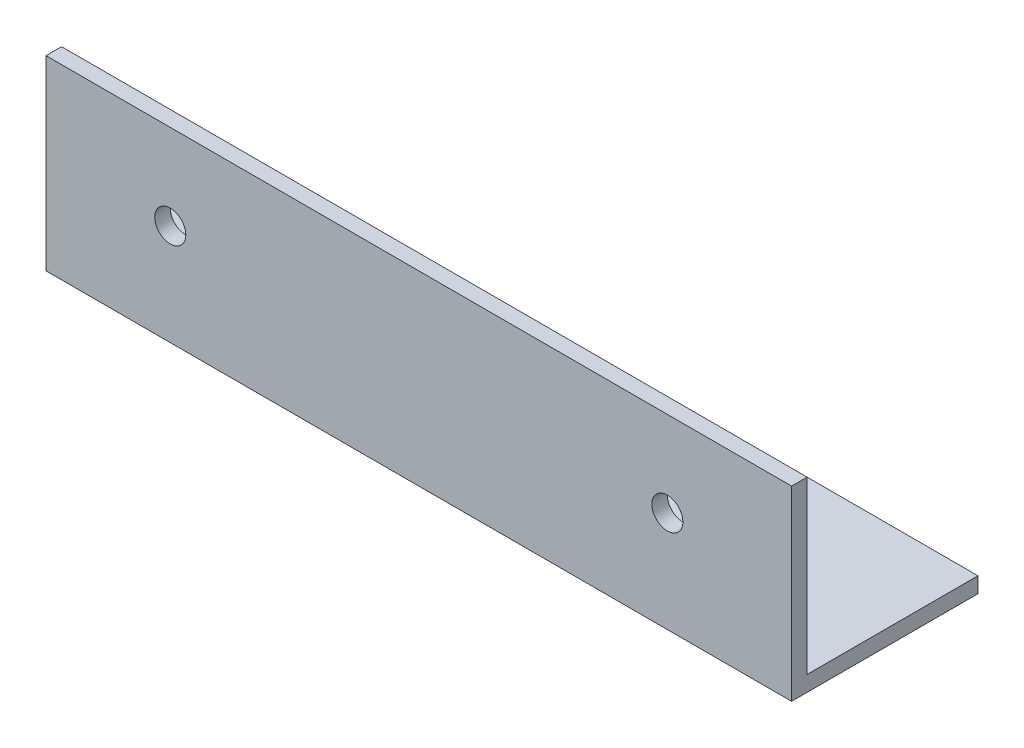
ISO-10303-21;
HEADER;
FILE_DESCRIPTION(('STEP AP214'),'2;1');
FILE_NAME('part.step','',(''),(''),'','','');
FILE_SCHEMA(('AUTOMOTIVE_DESIGN { 1 0 10303 214 1 1 1 1 }'));
ENDSEC;
DATA;
#1=APPLICATION_CONTEXT('core data for automotive mechanical design processes');
#2=APPLICATION_PROTOCOL_DEFINITION('international standard','automotive_design',2000,#1);
#3=PRODUCT_CONTEXT('',#1,'mechanical');
#4=PRODUCT('Part','Part','',(#3));
#5=PRODUCT_RELATED_PRODUCT_CATEGORY('part','',(#4));
#6=PRODUCT_DEFINITION_FORMATION('','',#4);
#7=PRODUCT_DEFINITION_CONTEXT('part definition',#1,'design');
#8=PRODUCT_DEFINITION('design','',#6,#7);
#9=PRODUCT_DEFINITION_SHAPE('','',#8);
#10=(LENGTH_UNIT() NAMED_UNIT(*) SI_UNIT(.MILLI.,.METRE.));
#11=(NAMED_UNIT(*) PLANE_ANGLE_UNIT() SI_UNIT($,.RADIAN.));
#12=(NAMED_UNIT(*) SI_UNIT($,.STERADIAN.) SOLID_ANGLE_UNIT());
#13=UNCERTAINTY_MEASURE_WITH_UNIT(LENGTH_MEASURE(1.E-05),#10,'distance_accuracy_value','');
#14=(GEOMETRIC_REPRESENTATION_CONTEXT(3) GLOBAL_UNCERTAINTY_ASSIGNED_CONTEXT((#13)) GLOBAL_UNIT_ASSIGNED_CONTEXT((#10,
#11,#12)) REPRESENTATION_CONTEXT('',''));
#15=CARTESIAN_POINT('',(0.,0.,0.));
#16=DIRECTION('',(0.,0.,1.));
#17=DIRECTION('',(1.,0.,0.));
#18=AXIS2_PLACEMENT_3D('',#15,#16,#17);
#19=CARTESIAN_POINT('',(152.4,0.,-38.1));
#20=DIRECTION('',(0.,1.,0.));
#21=DIRECTION('',(0.,0.,1.));
#22=AXIS2_PLACEMENT_3D('',#19,#20,#21);
#23=PLANE('',#22);
#24=CARTESIAN_POINT('',(127.,0.,-20.6375));
#25=DIRECTION('',(0.,1.,0.));
#26=DIRECTION('',(0.,0.,-1.));
#27=AXIS2_PLACEMENT_3D('',#24,#25,#26);
#28=CIRCLE('',#27,3.175);
#29=CARTESIAN_POINT('',(127.,0.,-23.8125));
#30=VERTEX_POINT('',#29);
#31=EDGE_CURVE('E163',#30,#30,#28,.T.);
#32=ORIENTED_EDGE('',*,*,#31,.T.);
#33=EDGE_LOOP('',(#32));
#34=FACE_BOUND('',#33,.T.);
#35=CARTESIAN_POINT('',(25.4,0.,-20.6375));
#36=DIRECTION('',(0.,1.,0.));
#37=DIRECTION('',(0.,0.,1.));
#38=AXIS2_PLACEMENT_3D('',#35,#36,#37);
#39=CIRCLE('',#38,3.175);
#40=CARTESIAN_POINT('',(25.4,0.,-17.4625));
#41=VERTEX_POINT('',#40);
#42=EDGE_CURVE('E166',#41,#41,#39,.T.);
#43=ORIENTED_EDGE('',*,*,#42,.T.);
#44=EDGE_LOOP('',(#43));
#45=FACE_BOUND('',#44,.T.);
#46=DIRECTION('',(0.,0.,-1.));
#47=VECTOR('',#46,1.);
#48=CARTESIAN_POINT('',(0.,0.,-38.1));
#49=LINE('',#48,#47);
#50=CARTESIAN_POINT('',(0.,0.,0.));
#51=VERTEX_POINT('',#50);
#52=CARTESIAN_POINT('',(0.,0.,-38.1));
#53=VERTEX_POINT('',#52);
#54=EDGE_CURVE('E117',#51,#53,#49,.T.);
#55=ORIENTED_EDGE('',*,*,#54,.T.);
#56=DIRECTION('',(-1.,0.,0.));
#57=VECTOR('',#56,1.);
#58=CARTESIAN_POINT('',(152.4,0.,-38.1));
#59=LINE('',#58,#57);
#60=CARTESIAN_POINT('',(152.4,0.,-38.1));
#61=VERTEX_POINT('',#60);
#62=EDGE_CURVE('E11',#61,#53,#59,.T.);
#63=ORIENTED_EDGE('',*,*,#62,.F.);
#64=DIRECTION('',(0.,0.,-1.));
#65=VECTOR('',#64,1.);
#66=CARTESIAN_POINT('',(152.4,0.,-38.1));
#67=LINE('',#66,#65);
#68=CARTESIAN_POINT('',(152.4,0.,0.));
#69=VERTEX_POINT('',#68);
#70=EDGE_CURVE('E128',#69,#61,#67,.T.);
#71=ORIENTED_EDGE('',*,*,#70,.F.);
#72=DIRECTION('',(-1.,0.,0.));
#73=VECTOR('',#72,1.);
#74=CARTESIAN_POINT('',(152.4,0.,0.));
#75=LINE('',#74,#73);
#76=EDGE_CURVE('E113',#69,#51,#75,.T.);
#77=ORIENTED_EDGE('',*,*,#76,.T.);
#78=EDGE_LOOP('',(#55,#63,#71,#77));
#79=FACE_BOUND('',#78,.T.);
#80=ADVANCED_FACE('F33',(#34,#45,#79),#23,.F.);
#81=CARTESIAN_POINT('',(152.4,3.175,-38.1));
#82=DIRECTION('',(0.,0.,1.));
#83=DIRECTION('',(1.,0.,0.));
#84=AXIS2_PLACEMENT_3D('',#81,#82,#83);
#85=PLANE('',#84);
#86=DIRECTION('',(0.,1.,0.));
#87=VECTOR('',#86,1.);
#88=CARTESIAN_POINT('',(0.,3.175,-38.1));
#89=LINE('',#88,#87);
#90=CARTESIAN_POINT('',(0.,3.175,-38.1));
#91=VERTEX_POINT('',#90);
#92=EDGE_CURVE('E120',#53,#91,#89,.T.);
#93=ORIENTED_EDGE('',*,*,#92,.T.);
#94=DIRECTION('',(-1.,0.,0.));
#95=VECTOR('',#94,1.);
#96=CARTESIAN_POINT('',(152.4,3.175,-38.1));
#97=LINE('',#96,#95);
#98=CARTESIAN_POINT('',(152.4,3.175,-38.1));
#99=VERTEX_POINT('',#98);
#100=EDGE_CURVE('E41',#99,#91,#97,.T.);
#101=ORIENTED_EDGE('',*,*,#100,.F.);
#102=DIRECTION('',(0.,1.,0.));
#103=VECTOR('',#102,1.);
#104=CARTESIAN_POINT('',(152.4,3.175,-38.1));
#105=LINE('',#104,#103);
#106=EDGE_CURVE('E86',#61,#99,#105,.T.);
#107=ORIENTED_EDGE('',*,*,#106,.F.);
#108=ORIENTED_EDGE('',*,*,#62,.T.);
#109=EDGE_LOOP('',(#93,#101,#107,#108));
#110=FACE_BOUND('',#109,.T.);
#111=ADVANCED_FACE('F155',(#110),#85,.F.);
#112=CARTESIAN_POINT('',(152.4,3.175,-3.175));
#113=DIRECTION('',(0.,-1.,0.));
#114=DIRECTION('',(0.,0.,-1.));
#115=AXIS2_PLACEMENT_3D('',#112,#113,#114);
#116=PLANE('',#115);
#117=CARTESIAN_POINT('',(127.,3.175,-20.6375));
#118=DIRECTION('',(0.,1.,0.));
#119=DIRECTION('',(0.,0.,-1.));
#120=AXIS2_PLACEMENT_3D('',#117,#118,#119);
#121=CIRCLE('',#120,3.175);
#122=CARTESIAN_POINT('',(127.,3.175,-23.8125));
#123=VERTEX_POINT('',#122);
#124=EDGE_CURVE('E177',#123,#123,#121,.T.);
#125=ORIENTED_EDGE('',*,*,#124,.F.);
#126=EDGE_LOOP('',(#125));
#127=FACE_BOUND('',#126,.T.);
#128=CARTESIAN_POINT('',(25.4,3.175,-20.6375));
#129=DIRECTION('',(0.,1.,0.));
#130=DIRECTION('',(0.,0.,1.));
#131=AXIS2_PLACEMENT_3D('',#128,#129,#130);
#132=CIRCLE('',#131,3.175);
#133=CARTESIAN_POINT('',(25.4,3.175,-17.4625));
#134=VERTEX_POINT('',#133);
#135=EDGE_CURVE('E169',#134,#134,#132,.T.);
#136=ORIENTED_EDGE('',*,*,#135,.F.);
#137=EDGE_LOOP('',(#136));
#138=FACE_BOUND('',#137,.T.);
#139=DIRECTION('',(0.,0.,1.));
#140=VECTOR('',#139,1.);
#141=CARTESIAN_POINT('',(0.,3.175,-3.175));
#142=LINE('',#141,#140);
#143=CARTESIAN_POINT('',(0.,3.175,-3.175));
#144=VERTEX_POINT('',#143);
#145=EDGE_CURVE('E123',#91,#144,#142,.T.);
#146=ORIENTED_EDGE('',*,*,#145,.T.);
#147=DIRECTION('',(-1.,0.,0.));
#148=VECTOR('',#147,1.);
#149=CARTESIAN_POINT('',(152.4,3.175,-3.175));
#150=LINE('',#149,#148);
#151=CARTESIAN_POINT('',(152.4,3.175,-3.175));
#152=VERTEX_POINT('',#151);
#153=EDGE_CURVE('E108',#152,#144,#150,.T.);
#154=ORIENTED_EDGE('',*,*,#153,.F.);
#155=DIRECTION('',(0.,0.,1.));
#156=VECTOR('',#155,1.);
#157=CARTESIAN_POINT('',(152.4,3.175,-3.175));
#158=LINE('',#157,#156);
#159=EDGE_CURVE('E99',#99,#152,#158,.T.);
#160=ORIENTED_EDGE('',*,*,#159,.F.);
#161=ORIENTED_EDGE('',*,*,#100,.T.);
#162=EDGE_LOOP('',(#146,#154,#160,#161));
#163=FACE_BOUND('',#162,.T.);
#164=ADVANCED_FACE('F134',(#127,#138,#163),#116,.F.);
#165=CARTESIAN_POINT('',(152.4,38.1,-3.175));
#166=DIRECTION('',(0.,0.,1.));
#167=DIRECTION('',(0.,-1.,0.));
#168=AXIS2_PLACEMENT_3D('',#165,#166,#167);
#169=PLANE('',#168);
#170=CARTESIAN_POINT('',(25.4,20.6375,-3.175));
#171=DIRECTION('',(0.,0.,-1.));
#172=DIRECTION('',(0.,-1.,0.));
#173=AXIS2_PLACEMENT_3D('',#170,#171,#172);
#174=CIRCLE('',#173,3.175);
#175=CARTESIAN_POINT('',(25.4,17.4625,-3.175));
#176=VERTEX_POINT('',#175);
#177=EDGE_CURVE('E168',#176,#176,#174,.T.);
#178=ORIENTED_EDGE('',*,*,#177,.F.);
#179=EDGE_LOOP('',(#178));
#180=FACE_BOUND('',#179,.T.);
#181=CARTESIAN_POINT('',(127.,20.6375,-3.175));
#182=DIRECTION('',(0.,0.,-1.));
#183=DIRECTION('',(0.,1.,0.));
#184=AXIS2_PLACEMENT_3D('',#181,#182,#183);
#185=CIRCLE('',#184,3.175);
#186=CARTESIAN_POINT('',(127.,23.8125,-3.175));
#187=VERTEX_POINT('',#186);
#188=EDGE_CURVE('E180',#187,#187,#185,.T.);
#189=ORIENTED_EDGE('',*,*,#188,.F.);
#190=EDGE_LOOP('',(#189));
#191=FACE_BOUND('',#190,.T.);
#192=DIRECTION('',(0.,1.,0.));
#193=VECTOR('',#192,1.);
#194=CARTESIAN_POINT('',(0.,38.1,-3.175));
#195=LINE('',#194,#193);
#196=CARTESIAN_POINT('',(0.,38.1,-3.175));
#197=VERTEX_POINT('',#196);
#198=EDGE_CURVE('E107',#144,#197,#195,.T.);
#199=ORIENTED_EDGE('',*,*,#198,.T.);
#200=DIRECTION('',(-1.,0.,0.));
#201=VECTOR('',#200,1.);
#202=CARTESIAN_POINT('',(152.4,38.1,-3.175));
#203=LINE('',#202,#201);
#204=CARTESIAN_POINT('',(152.4,38.1,-3.175));
#205=VERTEX_POINT('',#204);
#206=EDGE_CURVE('E104',#205,#197,#203,.T.);
#207=ORIENTED_EDGE('',*,*,#206,.F.);
#208=DIRECTION('',(0.,1.,0.));
#209=VECTOR('',#208,1.);
#210=CARTESIAN_POINT('',(152.4,38.1,-3.175));
#211=LINE('',#210,#209);
#212=EDGE_CURVE('E93',#152,#205,#211,.T.);
#213=ORIENTED_EDGE('',*,*,#212,.F.);
#214=ORIENTED_EDGE('',*,*,#153,.T.);
#215=EDGE_LOOP('',(#199,#207,#213,#214));
#216=FACE_BOUND('',#215,.T.);
#217=ADVANCED_FACE('F105',(#180,#191,#216),#169,.F.);
#218=CARTESIAN_POINT('',(152.4,38.1,0.));
#219=DIRECTION('',(0.,-1.,0.));
#220=DIRECTION('',(0.,0.,-1.));
#221=AXIS2_PLACEMENT_3D('',#218,#219,#220);
#222=PLANE('',#221);
#223=DIRECTION('',(0.,0.,1.));
#224=VECTOR('',#223,1.);
#225=CARTESIAN_POINT('',(0.,38.1,0.));
#226=LINE('',#225,#224);
#227=CARTESIAN_POINT('',(0.,38.1,0.));
#228=VERTEX_POINT('',#227);
#229=EDGE_CURVE('E72',#197,#228,#226,.T.);
#230=ORIENTED_EDGE('',*,*,#229,.T.);
#231=DIRECTION('',(-1.,0.,0.));
#232=VECTOR('',#231,1.);
#233=CARTESIAN_POINT('',(152.4,38.1,0.));
#234=LINE('',#233,#232);
#235=CARTESIAN_POINT('',(152.4,38.1,0.));
#236=VERTEX_POINT('',#235);
#237=EDGE_CURVE('E109',#236,#228,#234,.T.);
#238=ORIENTED_EDGE('',*,*,#237,.F.);
#239=DIRECTION('',(0.,0.,1.));
#240=VECTOR('',#239,1.);
#241=CARTESIAN_POINT('',(152.4,38.1,0.));
#242=LINE('',#241,#240);
#243=EDGE_CURVE('E97',#205,#236,#242,.T.);
#244=ORIENTED_EDGE('',*,*,#243,.F.);
#245=ORIENTED_EDGE('',*,*,#206,.T.);
#246=EDGE_LOOP('',(#230,#238,#244,#245));
#247=FACE_BOUND('',#246,.T.);
#248=ADVANCED_FACE('F111',(#247),#222,.F.);
#249=CARTESIAN_POINT('',(152.4,0.,0.));
#250=DIRECTION('',(0.,0.,-1.));
#251=DIRECTION('',(-1.,0.,0.));
#252=AXIS2_PLACEMENT_3D('',#249,#250,#251);
#253=PLANE('',#252);
#254=CARTESIAN_POINT('',(25.4,20.6375,0.));
#255=DIRECTION('',(0.,0.,-1.));
#256=DIRECTION('',(0.,-1.,0.));
#257=AXIS2_PLACEMENT_3D('',#254,#255,#256);
#258=CIRCLE('',#257,3.175);
#259=CARTESIAN_POINT('',(25.4,17.4625,0.));
#260=VERTEX_POINT('',#259);
#261=EDGE_CURVE('E172',#260,#260,#258,.T.);
#262=ORIENTED_EDGE('',*,*,#261,.T.);
#263=EDGE_LOOP('',(#262));
#264=FACE_BOUND('',#263,.T.);
#265=CARTESIAN_POINT('',(127.,20.6375,0.));
#266=DIRECTION('',(0.,0.,-1.));
#267=DIRECTION('',(0.,1.,0.));
#268=AXIS2_PLACEMENT_3D('',#265,#266,#267);
#269=CIRCLE('',#268,3.175);
#270=CARTESIAN_POINT('',(127.,23.8125,0.));
#271=VERTEX_POINT('',#270);
#272=EDGE_CURVE('E121',#271,#271,#269,.T.);
#273=ORIENTED_EDGE('',*,*,#272,.T.);
#274=EDGE_LOOP('',(#273));
#275=FACE_BOUND('',#274,.T.);
#276=DIRECTION('',(0.,-1.,0.));
#277=VECTOR('',#276,1.);
#278=CARTESIAN_POINT('',(0.,0.,0.));
#279=LINE('',#278,#277);
#280=EDGE_CURVE('E78',#228,#51,#279,.T.);
#281=ORIENTED_EDGE('',*,*,#280,.T.);
#282=ORIENTED_EDGE('',*,*,#76,.F.);
#283=DIRECTION('',(0.,-1.,0.));
#284=VECTOR('',#283,1.);
#285=CARTESIAN_POINT('',(152.4,0.,0.));
#286=LINE('',#285,#284);
#287=EDGE_CURVE('E49',#236,#69,#286,.T.);
#288=ORIENTED_EDGE('',*,*,#287,.F.);
#289=ORIENTED_EDGE('',*,*,#237,.T.);
#290=EDGE_LOOP('',(#281,#282,#288,#289));
#291=FACE_BOUND('',#290,.T.);
#292=ADVANCED_FACE('F141',(#264,#275,#291),#253,.F.);
#293=CARTESIAN_POINT('',(152.4,0.,0.));
#294=DIRECTION('',(-1.,0.,0.));
#295=DIRECTION('',(0.,0.,1.));
#296=AXIS2_PLACEMENT_3D('',#293,#294,#295);
#297=PLANE('',#296);
#298=ORIENTED_EDGE('',*,*,#70,.T.);
#299=ORIENTED_EDGE('',*,*,#106,.T.);
#300=ORIENTED_EDGE('',*,*,#159,.T.);
#301=ORIENTED_EDGE('',*,*,#212,.T.);
#302=ORIENTED_EDGE('',*,*,#243,.T.);
#303=ORIENTED_EDGE('',*,*,#287,.T.);
#304=EDGE_LOOP('',(#298,#299,#300,#301,#302,#303));
#305=FACE_BOUND('',#304,.T.);
#306=ADVANCED_FACE('F95',(#305),#297,.F.);
#307=CARTESIAN_POINT('',(0.,0.,0.));
#308=DIRECTION('',(-1.,0.,0.));
#309=DIRECTION('',(0.,0.,1.));
#310=AXIS2_PLACEMENT_3D('',#307,#308,#309);
#311=PLANE('',#310);
#312=ORIENTED_EDGE('',*,*,#54,.F.);
#313=ORIENTED_EDGE('',*,*,#280,.F.);
#314=ORIENTED_EDGE('',*,*,#229,.F.);
#315=ORIENTED_EDGE('',*,*,#198,.F.);
#316=ORIENTED_EDGE('',*,*,#145,.F.);
#317=ORIENTED_EDGE('',*,*,#92,.F.);
#318=EDGE_LOOP('',(#312,#313,#314,#315,#316,#317));
#319=FACE_BOUND('',#318,.T.);
#320=ADVANCED_FACE('F137',(#319),#311,.T.);
#321=CARTESIAN_POINT('',(127.,20.6375,0.));
#322=DIRECTION('',(0.,0.,-1.));
#323=DIRECTION('',(0.,1.,0.));
#324=AXIS2_PLACEMENT_3D('',#321,#322,#323);
#325=CYLINDRICAL_SURFACE('',#324,3.175);
#326=ORIENTED_EDGE('',*,*,#272,.F.);
#327=EDGE_LOOP('',(#326));
#328=FACE_BOUND('',#327,.T.);
#329=ORIENTED_EDGE('',*,*,#188,.T.);
#330=EDGE_LOOP('',(#329));
#331=FACE_BOUND('',#330,.T.);
#332=ADVANCED_FACE('F189',(#328,#331),#325,.F.);
#333=CARTESIAN_POINT('',(25.4,20.6375,0.));
#334=DIRECTION('',(0.,0.,-1.));
#335=DIRECTION('',(0.,1.,0.));
#336=AXIS2_PLACEMENT_3D('',#333,#334,#335);
#337=CYLINDRICAL_SURFACE('',#336,3.175);
#338=ORIENTED_EDGE('',*,*,#261,.F.);
#339=EDGE_LOOP('',(#338));
#340=FACE_BOUND('',#339,.T.);
#341=ORIENTED_EDGE('',*,*,#177,.T.);
#342=EDGE_LOOP('',(#341));
#343=FACE_BOUND('',#342,.T.);
#344=ADVANCED_FACE('F201',(#340,#343),#337,.F.);
#345=CARTESIAN_POINT('',(25.4,0.,-20.6375));
#346=DIRECTION('',(0.,1.,0.));
#347=DIRECTION('',(0.,0.,1.));
#348=AXIS2_PLACEMENT_3D('',#345,#346,#347);
#349=CYLINDRICAL_SURFACE('',#348,3.175);
#350=ORIENTED_EDGE('',*,*,#42,.F.);
#351=EDGE_LOOP('',(#350));
#352=FACE_BOUND('',#351,.T.);
#353=ORIENTED_EDGE('',*,*,#135,.T.);
#354=EDGE_LOOP('',(#353));
#355=FACE_BOUND('',#354,.T.);
#356=ADVANCED_FACE('F203',(#352,#355),#349,.F.);
#357=CARTESIAN_POINT('',(127.,0.,-20.6375));
#358=DIRECTION('',(0.,1.,0.));
#359=DIRECTION('',(0.,0.,1.));
#360=AXIS2_PLACEMENT_3D('',#357,#358,#359);
#361=CYLINDRICAL_SURFACE('',#360,3.175);
#362=ORIENTED_EDGE('',*,*,#31,.F.);
#363=EDGE_LOOP('',(#362));
#364=FACE_BOUND('',#363,.T.);
#365=ORIENTED_EDGE('',*,*,#124,.T.);
#366=EDGE_LOOP('',(#365));
#367=FACE_BOUND('',#366,.T.);
#368=ADVANCED_FACE('F210',(#364,#367),#361,.F.);
#369=CLOSED_SHELL('',(#80,#111,#164,#217,#248,#292,#306,#320,#332,#344,#356,#368));
#370=MANIFOLD_SOLID_BREP('B2',#369);
#371=ADVANCED_BREP_SHAPE_REPRESENTATION('',(#18,#370),#14);
#372=SHAPE_DEFINITION_REPRESENTATION(#9,#371);
ENDSEC;
END-ISO-10303-21;
